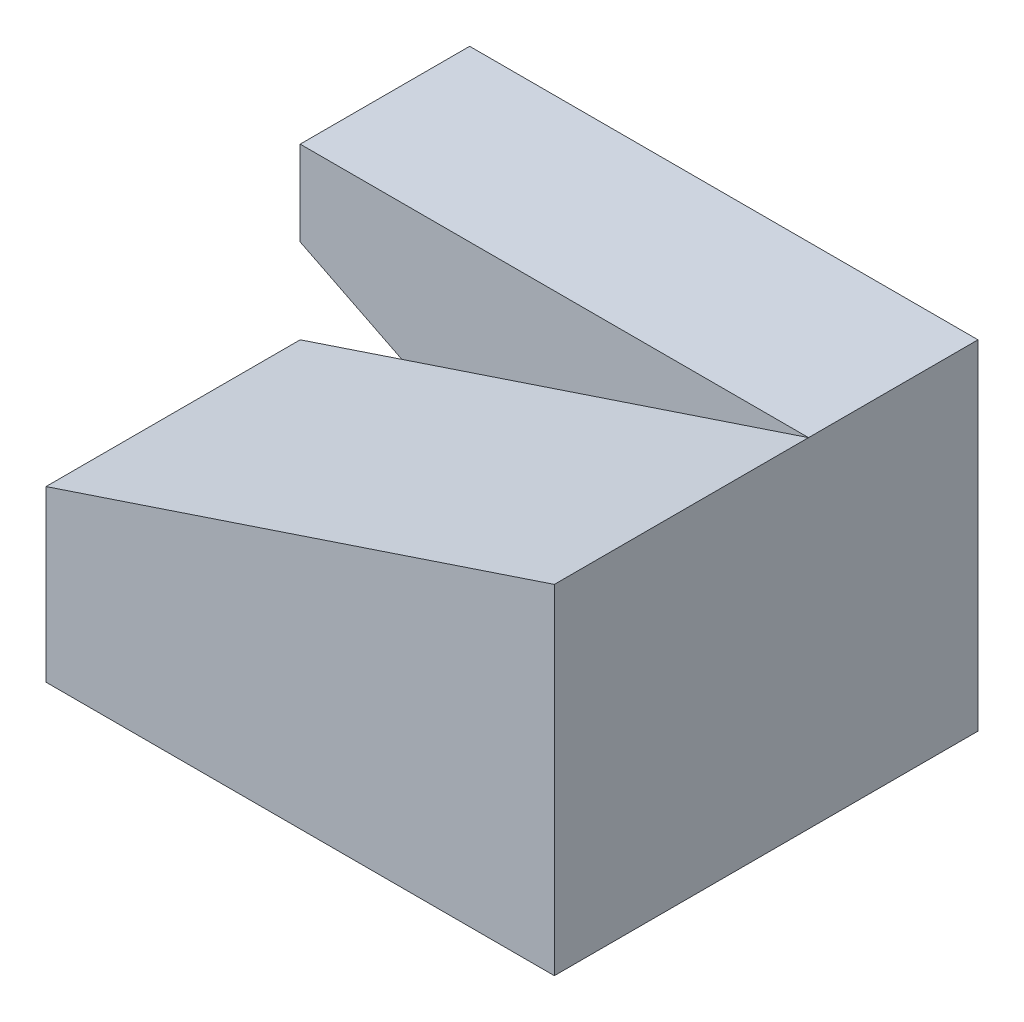
ISO-10303-21;
HEADER;
FILE_DESCRIPTION(('STEP AP214'),'2;1');
FILE_NAME('part.step','',(''),(''),'','','');
FILE_SCHEMA(('AUTOMOTIVE_DESIGN { 1 0 10303 214 1 1 1 1 }'));
ENDSEC;
DATA;
#1=APPLICATION_CONTEXT('core data for automotive mechanical design processes');
#2=APPLICATION_PROTOCOL_DEFINITION('international standard','automotive_design',2000,#1);
#3=PRODUCT_CONTEXT('',#1,'mechanical');
#4=PRODUCT('Part','Part','',(#3));
#5=PRODUCT_RELATED_PRODUCT_CATEGORY('part','',(#4));
#6=PRODUCT_DEFINITION_FORMATION('','',#4);
#7=PRODUCT_DEFINITION_CONTEXT('part definition',#1,'design');
#8=PRODUCT_DEFINITION('design','',#6,#7);
#9=PRODUCT_DEFINITION_SHAPE('','',#8);
#10=(LENGTH_UNIT() NAMED_UNIT(*) SI_UNIT(.MILLI.,.METRE.));
#11=(NAMED_UNIT(*) PLANE_ANGLE_UNIT() SI_UNIT($,.RADIAN.));
#12=(NAMED_UNIT(*) SI_UNIT($,.STERADIAN.) SOLID_ANGLE_UNIT());
#13=UNCERTAINTY_MEASURE_WITH_UNIT(LENGTH_MEASURE(1.E-05),#10,'distance_accuracy_value','');
#14=(GEOMETRIC_REPRESENTATION_CONTEXT(3) GLOBAL_UNCERTAINTY_ASSIGNED_CONTEXT((#13)) GLOBAL_UNIT_ASSIGNED_CONTEXT((#10,
#11,#12)) REPRESENTATION_CONTEXT('',''));
#15=CARTESIAN_POINT('',(0.,0.,0.));
#16=DIRECTION('',(0.,0.,1.));
#17=DIRECTION('',(1.,0.,0.));
#18=AXIS2_PLACEMENT_3D('',#15,#16,#17);
#19=CARTESIAN_POINT('',(0.,0.,0.));
#20=DIRECTION('',(0.,0.,1.));
#21=DIRECTION('',(1.,0.,0.));
#22=AXIS2_PLACEMENT_3D('',#19,#20,#21);
#23=PLANE('',#22);
#24=DIRECTION('',(-0.894427190999916,0.447213595499958,0.));
#25=VECTOR('',#24,1.);
#26=CARTESIAN_POINT('',(-36.7521367521367,11.2820512820513,0.));
#27=LINE('',#26,#25);
#28=CARTESIAN_POINT('',(-6.75213675213675,-3.71794871794872,0.));
#29=VERTEX_POINT('',#28);
#30=CARTESIAN_POINT('',(-30.7521367521367,8.28205128205128,0.));
#31=VERTEX_POINT('',#30);
#32=EDGE_CURVE('E68',#29,#31,#27,.T.);
#33=ORIENTED_EDGE('',*,*,#32,.F.);
#34=DIRECTION('',(1.,0.,0.));
#35=VECTOR('',#34,1.);
#36=CARTESIAN_POINT('',(-36.7521367521367,-3.71794871794872,0.));
#37=LINE('',#36,#35);
#38=CARTESIAN_POINT('',(-36.7521367521367,-3.71794871794872,0.));
#39=VERTEX_POINT('',#38);
#40=EDGE_CURVE('E140',#39,#29,#37,.T.);
#41=ORIENTED_EDGE('',*,*,#40,.F.);
#42=DIRECTION('',(0.,-1.,0.));
#43=VECTOR('',#42,1.);
#44=CARTESIAN_POINT('',(-36.7521367521367,6.28205128205128,0.));
#45=LINE('',#44,#43);
#46=CARTESIAN_POINT('',(-36.7521367521367,6.28205128205128,0.));
#47=VERTEX_POINT('',#46);
#48=EDGE_CURVE('E145',#47,#39,#45,.T.);
#49=ORIENTED_EDGE('',*,*,#48,.F.);
#50=DIRECTION('',(-0.948683298050514,-0.316227766016838,0.));
#51=VECTOR('',#50,1.);
#52=CARTESIAN_POINT('',(-6.75213675213675,16.2820512820513,0.));
#53=LINE('',#52,#51);
#54=EDGE_CURVE('E130',#31,#47,#53,.T.);
#55=ORIENTED_EDGE('',*,*,#54,.F.);
#56=EDGE_LOOP('',(#33,#41,#49,#55));
#57=FACE_BOUND('',#56,.T.);
#58=ADVANCED_FACE('F33',(#57),#23,.F.);
#59=CARTESIAN_POINT('',(-6.75213675213675,16.2820512820513,15.));
#60=DIRECTION('',(0.316227766016838,-0.948683298050514,0.));
#61=DIRECTION('',(0.948683298050514,0.316227766016838,0.));
#62=AXIS2_PLACEMENT_3D('',#59,#60,#61);
#63=PLANE('',#62);
#64=CARTESIAN_POINT('',(-6.75213675213675,16.2820512820513,0.));
#65=VERTEX_POINT('',#64);
#66=EDGE_CURVE('E132',#65,#31,#53,.T.);
#67=ORIENTED_EDGE('',*,*,#66,.T.);
#68=ORIENTED_EDGE('',*,*,#54,.T.);
#69=DIRECTION('',(0.,0.,-1.));
#70=VECTOR('',#69,1.);
#71=CARTESIAN_POINT('',(-36.7521367521367,6.28205128205128,15.));
#72=LINE('',#71,#70);
#73=CARTESIAN_POINT('',(-36.7521367521367,6.28205128205128,15.));
#74=VERTEX_POINT('',#73);
#75=EDGE_CURVE('E11',#74,#47,#72,.T.);
#76=ORIENTED_EDGE('',*,*,#75,.F.);
#77=DIRECTION('',(-0.948683298050514,-0.316227766016838,0.));
#78=VECTOR('',#77,1.);
#79=CARTESIAN_POINT('',(-6.75213675213675,16.2820512820513,15.));
#80=LINE('',#79,#78);
#81=CARTESIAN_POINT('',(-6.75213675213675,16.2820512820513,15.));
#82=VERTEX_POINT('',#81);
#83=EDGE_CURVE('E138',#82,#74,#80,.T.);
#84=ORIENTED_EDGE('',*,*,#83,.F.);
#85=DIRECTION('',(0.,0.,-1.));
#86=VECTOR('',#85,1.);
#87=CARTESIAN_POINT('',(-6.75213675213675,16.2820512820513,15.));
#88=LINE('',#87,#86);
#89=EDGE_CURVE('E75',#82,#65,#88,.T.);
#90=ORIENTED_EDGE('',*,*,#89,.T.);
#91=EDGE_LOOP('',(#67,#68,#76,#84,#90));
#92=FACE_BOUND('',#91,.T.);
#93=ADVANCED_FACE('F35',(#92),#63,.F.);
#94=CARTESIAN_POINT('',(-36.7521367521367,6.28205128205128,15.));
#95=DIRECTION('',(1.,0.,0.));
#96=DIRECTION('',(0.,0.,-1.));
#97=AXIS2_PLACEMENT_3D('',#94,#95,#96);
#98=PLANE('',#97);
#99=ORIENTED_EDGE('',*,*,#48,.T.);
#100=DIRECTION('',(0.,0.,-1.));
#101=VECTOR('',#100,1.);
#102=CARTESIAN_POINT('',(-36.7521367521367,-3.71794871794872,15.));
#103=LINE('',#102,#101);
#104=CARTESIAN_POINT('',(-36.7521367521367,-3.71794871794872,15.));
#105=VERTEX_POINT('',#104);
#106=EDGE_CURVE('E42',#105,#39,#103,.T.);
#107=ORIENTED_EDGE('',*,*,#106,.F.);
#108=DIRECTION('',(0.,-1.,0.));
#109=VECTOR('',#108,1.);
#110=CARTESIAN_POINT('',(-36.7521367521367,6.28205128205128,15.));
#111=LINE('',#110,#109);
#112=EDGE_CURVE('E82',#74,#105,#111,.T.);
#113=ORIENTED_EDGE('',*,*,#112,.F.);
#114=ORIENTED_EDGE('',*,*,#75,.T.);
#115=EDGE_LOOP('',(#99,#107,#113,#114));
#116=FACE_BOUND('',#115,.T.);
#117=ADVANCED_FACE('F158',(#116),#98,.F.);
#118=CARTESIAN_POINT('',(-36.7521367521367,-3.71794871794872,15.));
#119=DIRECTION('',(0.,1.,0.));
#120=DIRECTION('',(0.,0.,1.));
#121=AXIS2_PLACEMENT_3D('',#118,#119,#120);
#122=PLANE('',#121);
#123=ORIENTED_EDGE('',*,*,#40,.T.);
#124=DIRECTION('',(0.,0.,-1.));
#125=VECTOR('',#124,1.);
#126=CARTESIAN_POINT('',(-6.75213675213675,-3.71794871794872,15.));
#127=LINE('',#126,#125);
#128=CARTESIAN_POINT('',(-6.75213675213675,-3.71794871794872,15.));
#129=VERTEX_POINT('',#128);
#130=EDGE_CURVE('E149',#129,#29,#127,.T.);
#131=ORIENTED_EDGE('',*,*,#130,.F.);
#132=DIRECTION('',(1.,0.,0.));
#133=VECTOR('',#132,1.);
#134=CARTESIAN_POINT('',(-36.7521367521367,-3.71794871794872,15.));
#135=LINE('',#134,#133);
#136=EDGE_CURVE('E142',#105,#129,#135,.T.);
#137=ORIENTED_EDGE('',*,*,#136,.F.);
#138=ORIENTED_EDGE('',*,*,#106,.T.);
#139=EDGE_LOOP('',(#123,#131,#137,#138));
#140=FACE_BOUND('',#139,.T.);
#141=ADVANCED_FACE('F154',(#140),#122,.F.);
#142=CARTESIAN_POINT('',(-6.75213675213675,-3.71794871794872,15.));
#143=DIRECTION('',(-1.,0.,0.));
#144=DIRECTION('',(0.,0.,1.));
#145=AXIS2_PLACEMENT_3D('',#142,#143,#144);
#146=PLANE('',#145);
#147=ORIENTED_EDGE('',*,*,#130,.T.);
#148=DIRECTION('',(0.,0.,1.));
#149=VECTOR('',#148,1.);
#150=CARTESIAN_POINT('',(-6.75213675213675,-3.71794871794872,-10.));
#151=LINE('',#150,#149);
#152=CARTESIAN_POINT('',(-6.75213675213675,-3.71794871794872,-10.));
#153=VERTEX_POINT('',#152);
#154=EDGE_CURVE('E171',#153,#29,#151,.T.);
#155=ORIENTED_EDGE('',*,*,#154,.F.);
#156=DIRECTION('',(0.,-1.,0.));
#157=VECTOR('',#156,1.);
#158=CARTESIAN_POINT('',(-6.75213675213675,-3.71794871794872,-10.));
#159=LINE('',#158,#157);
#160=CARTESIAN_POINT('',(-6.75213675213675,16.2820512820513,-10.));
#161=VERTEX_POINT('',#160);
#162=EDGE_CURVE('E120',#161,#153,#159,.T.);
#163=ORIENTED_EDGE('',*,*,#162,.F.);
#164=DIRECTION('',(0.,0.,1.));
#165=VECTOR('',#164,1.);
#166=CARTESIAN_POINT('',(-6.75213675213675,16.2820512820513,-10.));
#167=LINE('',#166,#165);
#168=EDGE_CURVE('E134',#161,#65,#167,.T.);
#169=ORIENTED_EDGE('',*,*,#168,.T.);
#170=ORIENTED_EDGE('',*,*,#89,.F.);
#171=DIRECTION('',(0.,1.,0.));
#172=VECTOR('',#171,1.);
#173=CARTESIAN_POINT('',(-6.75213675213675,-3.71794871794872,15.));
#174=LINE('',#173,#172);
#175=EDGE_CURVE('E50',#129,#82,#174,.T.);
#176=ORIENTED_EDGE('',*,*,#175,.F.);
#177=EDGE_LOOP('',(#147,#155,#163,#169,#170,#176));
#178=FACE_BOUND('',#177,.T.);
#179=ADVANCED_FACE('F170',(#178),#146,.F.);
#180=CARTESIAN_POINT('',(0.,0.,15.));
#181=DIRECTION('',(0.,0.,1.));
#182=DIRECTION('',(1.,0.,0.));
#183=AXIS2_PLACEMENT_3D('',#180,#181,#182);
#184=PLANE('',#183);
#185=ORIENTED_EDGE('',*,*,#83,.T.);
#186=ORIENTED_EDGE('',*,*,#112,.T.);
#187=ORIENTED_EDGE('',*,*,#136,.T.);
#188=ORIENTED_EDGE('',*,*,#175,.T.);
#189=EDGE_LOOP('',(#185,#186,#187,#188));
#190=FACE_BOUND('',#189,.T.);
#191=ADVANCED_FACE('F178',(#190),#184,.T.);
#192=CARTESIAN_POINT('',(0.,0.,0.));
#193=DIRECTION('',(0.,0.,1.));
#194=DIRECTION('',(1.,0.,0.));
#195=AXIS2_PLACEMENT_3D('',#192,#193,#194);
#196=PLANE('',#195);
#197=ORIENTED_EDGE('',*,*,#66,.F.);
#198=DIRECTION('',(1.,0.,0.));
#199=VECTOR('',#198,1.);
#200=CARTESIAN_POINT('',(-6.75213675213675,16.2820512820513,0.));
#201=LINE('',#200,#199);
#202=CARTESIAN_POINT('',(-36.7521367521367,16.2820512820513,0.));
#203=VERTEX_POINT('',#202);
#204=EDGE_CURVE('E124',#203,#65,#201,.T.);
#205=ORIENTED_EDGE('',*,*,#204,.F.);
#206=DIRECTION('',(0.,1.,0.));
#207=VECTOR('',#206,1.);
#208=CARTESIAN_POINT('',(-36.7521367521367,16.2820512820513,0.));
#209=LINE('',#208,#207);
#210=CARTESIAN_POINT('',(-36.7521367521367,11.2820512820513,0.));
#211=VERTEX_POINT('',#210);
#212=EDGE_CURVE('E167',#211,#203,#209,.T.);
#213=ORIENTED_EDGE('',*,*,#212,.F.);
#214=EDGE_CURVE('E128',#31,#211,#27,.T.);
#215=ORIENTED_EDGE('',*,*,#214,.F.);
#216=EDGE_LOOP('',(#197,#205,#213,#215));
#217=FACE_BOUND('',#216,.T.);
#218=ADVANCED_FACE('F162',(#217),#196,.T.);
#219=CARTESIAN_POINT('',(-36.7521367521367,11.2820512820513,-10.));
#220=DIRECTION('',(0.447213595499958,0.894427190999916,0.));
#221=DIRECTION('',(-0.894427190999916,0.447213595499958,0.));
#222=AXIS2_PLACEMENT_3D('',#219,#220,#221);
#223=PLANE('',#222);
#224=ORIENTED_EDGE('',*,*,#32,.T.);
#225=ORIENTED_EDGE('',*,*,#214,.T.);
#226=DIRECTION('',(0.,0.,1.));
#227=VECTOR('',#226,1.);
#228=CARTESIAN_POINT('',(-36.7521367521367,11.2820512820513,-10.));
#229=LINE('',#228,#227);
#230=CARTESIAN_POINT('',(-36.7521367521367,11.2820512820513,-10.));
#231=VERTEX_POINT('',#230);
#232=EDGE_CURVE('E109',#231,#211,#229,.T.);
#233=ORIENTED_EDGE('',*,*,#232,.F.);
#234=DIRECTION('',(-0.894427190999916,0.447213595499958,0.));
#235=VECTOR('',#234,1.);
#236=CARTESIAN_POINT('',(-36.7521367521367,11.2820512820513,-10.));
#237=LINE('',#236,#235);
#238=EDGE_CURVE('E115',#153,#231,#237,.T.);
#239=ORIENTED_EDGE('',*,*,#238,.F.);
#240=ORIENTED_EDGE('',*,*,#154,.T.);
#241=EDGE_LOOP('',(#224,#225,#233,#239,#240));
#242=FACE_BOUND('',#241,.T.);
#243=ADVANCED_FACE('F126',(#242),#223,.F.);
#244=CARTESIAN_POINT('',(-36.7521367521367,16.2820512820513,-10.));
#245=DIRECTION('',(1.,0.,0.));
#246=DIRECTION('',(0.,0.,-1.));
#247=AXIS2_PLACEMENT_3D('',#244,#245,#246);
#248=PLANE('',#247);
#249=ORIENTED_EDGE('',*,*,#212,.T.);
#250=DIRECTION('',(0.,0.,1.));
#251=VECTOR('',#250,1.);
#252=CARTESIAN_POINT('',(-36.7521367521367,16.2820512820513,-10.));
#253=LINE('',#252,#251);
#254=CARTESIAN_POINT('',(-36.7521367521367,16.2820512820513,-10.));
#255=VERTEX_POINT('',#254);
#256=EDGE_CURVE('E111',#255,#203,#253,.T.);
#257=ORIENTED_EDGE('',*,*,#256,.F.);
#258=DIRECTION('',(0.,1.,0.));
#259=VECTOR('',#258,1.);
#260=CARTESIAN_POINT('',(-36.7521367521367,16.2820512820513,-10.));
#261=LINE('',#260,#259);
#262=EDGE_CURVE('E105',#231,#255,#261,.T.);
#263=ORIENTED_EDGE('',*,*,#262,.F.);
#264=ORIENTED_EDGE('',*,*,#232,.T.);
#265=EDGE_LOOP('',(#249,#257,#263,#264));
#266=FACE_BOUND('',#265,.T.);
#267=ADVANCED_FACE('F107',(#266),#248,.F.);
#268=CARTESIAN_POINT('',(-6.75213675213675,16.2820512820513,-10.));
#269=DIRECTION('',(0.,-1.,0.));
#270=DIRECTION('',(0.,0.,-1.));
#271=AXIS2_PLACEMENT_3D('',#268,#269,#270);
#272=PLANE('',#271);
#273=ORIENTED_EDGE('',*,*,#204,.T.);
#274=ORIENTED_EDGE('',*,*,#168,.F.);
#275=DIRECTION('',(1.,0.,0.));
#276=VECTOR('',#275,1.);
#277=CARTESIAN_POINT('',(-6.75213675213675,16.2820512820513,-10.));
#278=LINE('',#277,#276);
#279=EDGE_CURVE('E114',#255,#161,#278,.T.);
#280=ORIENTED_EDGE('',*,*,#279,.F.);
#281=ORIENTED_EDGE('',*,*,#256,.T.);
#282=EDGE_LOOP('',(#273,#274,#280,#281));
#283=FACE_BOUND('',#282,.T.);
#284=ADVANCED_FACE('F166',(#283),#272,.F.);
#285=CARTESIAN_POINT('',(0.,0.,-10.));
#286=DIRECTION('',(0.,0.,1.));
#287=DIRECTION('',(1.,0.,0.));
#288=AXIS2_PLACEMENT_3D('',#285,#286,#287);
#289=PLANE('',#288);
#290=ORIENTED_EDGE('',*,*,#238,.T.);
#291=ORIENTED_EDGE('',*,*,#262,.T.);
#292=ORIENTED_EDGE('',*,*,#279,.T.);
#293=ORIENTED_EDGE('',*,*,#162,.T.);
#294=EDGE_LOOP('',(#290,#291,#292,#293));
#295=FACE_BOUND('',#294,.T.);
#296=ADVANCED_FACE('F118',(#295),#289,.F.);
#297=CLOSED_SHELL('',(#58,#93,#117,#141,#179,#191,#218,#243,#267,#284,#296));
#298=MANIFOLD_SOLID_BREP('B2',#297);
#299=ADVANCED_BREP_SHAPE_REPRESENTATION('',(#18,#298),#14);
#300=SHAPE_DEFINITION_REPRESENTATION(#9,#299);
ENDSEC;
END-ISO-10303-21;
